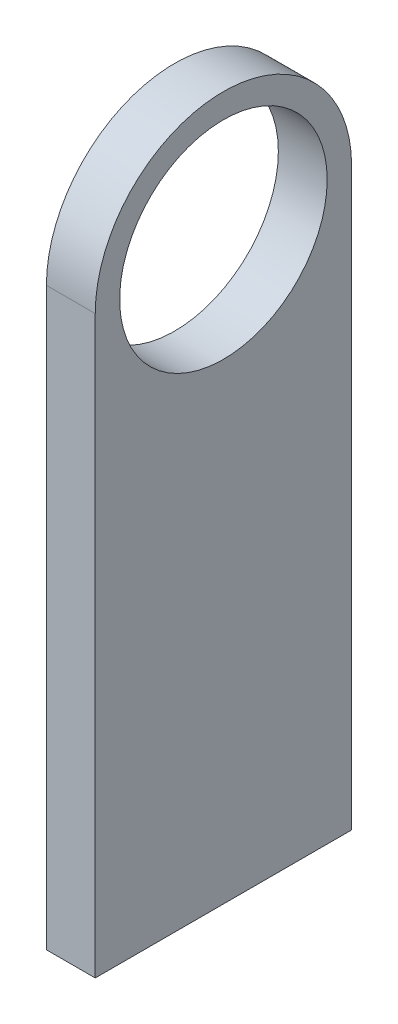
ISO-10303-21;
HEADER;
FILE_DESCRIPTION(('STEP AP214'),'2;1');
FILE_NAME('part.step','',(''),(''),'','','');
FILE_SCHEMA(('AUTOMOTIVE_DESIGN { 1 0 10303 214 1 1 1 1 }'));
ENDSEC;
DATA;
#1=APPLICATION_CONTEXT('core data for automotive mechanical design processes');
#2=APPLICATION_PROTOCOL_DEFINITION('international standard','automotive_design',2000,#1);
#3=PRODUCT_CONTEXT('',#1,'mechanical');
#4=PRODUCT('Part','Part','',(#3));
#5=PRODUCT_RELATED_PRODUCT_CATEGORY('part','',(#4));
#6=PRODUCT_DEFINITION_FORMATION('','',#4);
#7=PRODUCT_DEFINITION_CONTEXT('part definition',#1,'design');
#8=PRODUCT_DEFINITION('design','',#6,#7);
#9=PRODUCT_DEFINITION_SHAPE('','',#8);
#10=(LENGTH_UNIT() NAMED_UNIT(*) SI_UNIT(.MILLI.,.METRE.));
#11=(NAMED_UNIT(*) PLANE_ANGLE_UNIT() SI_UNIT($,.RADIAN.));
#12=(NAMED_UNIT(*) SI_UNIT($,.STERADIAN.) SOLID_ANGLE_UNIT());
#13=UNCERTAINTY_MEASURE_WITH_UNIT(LENGTH_MEASURE(1.E-05),#10,'distance_accuracy_value','');
#14=(GEOMETRIC_REPRESENTATION_CONTEXT(3) GLOBAL_UNCERTAINTY_ASSIGNED_CONTEXT((#13)) GLOBAL_UNIT_ASSIGNED_CONTEXT((#10,
#11,#12)) REPRESENTATION_CONTEXT('',''));
#15=CARTESIAN_POINT('',(0.,0.,0.));
#16=DIRECTION('',(0.,0.,1.));
#17=DIRECTION('',(1.,0.,0.));
#18=AXIS2_PLACEMENT_3D('',#15,#16,#17);
#19=CARTESIAN_POINT('',(4.,0.,10.500000000001));
#20=DIRECTION('',(0.,0.,-1.));
#21=DIRECTION('',(-1.,0.,0.));
#22=AXIS2_PLACEMENT_3D('',#19,#20,#21);
#23=PLANE('',#22);
#24=DIRECTION('',(0.,-1.,0.));
#25=VECTOR('',#24,1.);
#26=CARTESIAN_POINT('',(0.,0.,10.500000000001));
#27=LINE('',#26,#25);
#28=CARTESIAN_POINT('',(0.,0.,10.500000000001));
#29=VERTEX_POINT('',#28);
#30=CARTESIAN_POINT('',(0.,-47.1379081562873,10.500000000001));
#31=VERTEX_POINT('',#30);
#32=EDGE_CURVE('E103',#29,#31,#27,.T.);
#33=ORIENTED_EDGE('',*,*,#32,.T.);
#34=DIRECTION('',(-1.,0.,0.));
#35=VECTOR('',#34,1.);
#36=CARTESIAN_POINT('',(4.,-47.1379081562873,10.500000000001));
#37=LINE('',#36,#35);
#38=CARTESIAN_POINT('',(4.,-47.1379081562873,10.500000000001));
#39=VERTEX_POINT('',#38);
#40=EDGE_CURVE('E11',#39,#31,#37,.T.);
#41=ORIENTED_EDGE('',*,*,#40,.F.);
#42=DIRECTION('',(0.,-1.,0.));
#43=VECTOR('',#42,1.);
#44=CARTESIAN_POINT('',(4.,0.,10.500000000001));
#45=LINE('',#44,#43);
#46=CARTESIAN_POINT('',(4.,0.,10.500000000001));
#47=VERTEX_POINT('',#46);
#48=EDGE_CURVE('E85',#47,#39,#45,.T.);
#49=ORIENTED_EDGE('',*,*,#48,.F.);
#50=DIRECTION('',(-1.,0.,0.));
#51=VECTOR('',#50,1.);
#52=CARTESIAN_POINT('',(4.,0.,10.500000000001));
#53=LINE('',#52,#51);
#54=EDGE_CURVE('E102',#47,#29,#53,.T.);
#55=ORIENTED_EDGE('',*,*,#54,.T.);
#56=EDGE_LOOP('',(#33,#41,#49,#55));
#57=FACE_BOUND('',#56,.T.);
#58=ADVANCED_FACE('F37',(#57),#23,.F.);
#59=CARTESIAN_POINT('',(4.,-47.1379081562873,0.));
#60=DIRECTION('',(0.,1.,0.));
#61=DIRECTION('',(0.,0.,1.));
#62=AXIS2_PLACEMENT_3D('',#59,#60,#61);
#63=PLANE('',#62);
#64=DIRECTION('',(0.,0.,-1.));
#65=VECTOR('',#64,1.);
#66=CARTESIAN_POINT('',(0.,-47.1379081562873,0.));
#67=LINE('',#66,#65);
#68=CARTESIAN_POINT('',(0.,-47.1379081562873,-10.500000000001));
#69=VERTEX_POINT('',#68);
#70=EDGE_CURVE('E90',#31,#69,#67,.T.);
#71=ORIENTED_EDGE('',*,*,#70,.T.);
#72=DIRECTION('',(-1.,0.,0.));
#73=VECTOR('',#72,1.);
#74=CARTESIAN_POINT('',(4.,-47.1379081562873,-10.500000000001));
#75=LINE('',#74,#73);
#76=CARTESIAN_POINT('',(4.,-47.1379081562873,-10.500000000001));
#77=VERTEX_POINT('',#76);
#78=EDGE_CURVE('E45',#77,#69,#75,.T.);
#79=ORIENTED_EDGE('',*,*,#78,.F.);
#80=DIRECTION('',(0.,0.,-1.));
#81=VECTOR('',#80,1.);
#82=CARTESIAN_POINT('',(4.,-47.1379081562873,0.));
#83=LINE('',#82,#81);
#84=EDGE_CURVE('E79',#39,#77,#83,.T.);
#85=ORIENTED_EDGE('',*,*,#84,.F.);
#86=ORIENTED_EDGE('',*,*,#40,.T.);
#87=EDGE_LOOP('',(#71,#79,#85,#86));
#88=FACE_BOUND('',#87,.T.);
#89=ADVANCED_FACE('F89',(#88),#63,.F.);
#90=CARTESIAN_POINT('',(4.,0.,-10.500000000001));
#91=DIRECTION('',(0.,0.,-1.));
#92=DIRECTION('',(-1.,0.,0.));
#93=AXIS2_PLACEMENT_3D('',#90,#91,#92);
#94=PLANE('',#93);
#95=DIRECTION('',(0.,-1.,0.));
#96=VECTOR('',#95,1.);
#97=CARTESIAN_POINT('',(0.,0.,-10.500000000001));
#98=LINE('',#97,#96);
#99=CARTESIAN_POINT('',(0.,0.,-10.500000000001));
#100=VERTEX_POINT('',#99);
#101=EDGE_CURVE('E107',#100,#69,#98,.T.);
#102=ORIENTED_EDGE('',*,*,#101,.F.);
#103=DIRECTION('',(-1.,0.,0.));
#104=VECTOR('',#103,1.);
#105=CARTESIAN_POINT('',(4.,0.,-10.500000000001));
#106=LINE('',#105,#104);
#107=CARTESIAN_POINT('',(4.,0.,-10.500000000001));
#108=VERTEX_POINT('',#107);
#109=EDGE_CURVE('E69',#108,#100,#106,.T.);
#110=ORIENTED_EDGE('',*,*,#109,.F.);
#111=DIRECTION('',(0.,-1.,0.));
#112=VECTOR('',#111,1.);
#113=CARTESIAN_POINT('',(4.,0.,-10.500000000001));
#114=LINE('',#113,#112);
#115=EDGE_CURVE('E83',#108,#77,#114,.T.);
#116=ORIENTED_EDGE('',*,*,#115,.T.);
#117=ORIENTED_EDGE('',*,*,#78,.T.);
#118=EDGE_LOOP('',(#102,#110,#116,#117));
#119=FACE_BOUND('',#118,.T.);
#120=ADVANCED_FACE('F94',(#119),#94,.T.);
#121=CARTESIAN_POINT('',(4.,0.,0.));
#122=DIRECTION('',(-1.,0.,0.));
#123=DIRECTION('',(0.,0.,1.));
#124=AXIS2_PLACEMENT_3D('',#121,#122,#123);
#125=CYLINDRICAL_SURFACE('',#124,10.500000000001);
#126=CARTESIAN_POINT('',(0.,0.,0.));
#127=DIRECTION('',(1.,0.,0.));
#128=DIRECTION('',(0.,0.,-1.));
#129=AXIS2_PLACEMENT_3D('',#126,#127,#128);
#130=CIRCLE('',#129,10.500000000001);
#131=EDGE_CURVE('E72',#100,#29,#130,.T.);
#132=ORIENTED_EDGE('',*,*,#131,.T.);
#133=ORIENTED_EDGE('',*,*,#54,.F.);
#134=CARTESIAN_POINT('',(4.,0.,0.));
#135=DIRECTION('',(1.,0.,0.));
#136=DIRECTION('',(0.,0.,-1.));
#137=AXIS2_PLACEMENT_3D('',#134,#135,#136);
#138=CIRCLE('',#137,10.500000000001);
#139=EDGE_CURVE('E53',#108,#47,#138,.T.);
#140=ORIENTED_EDGE('',*,*,#139,.F.);
#141=ORIENTED_EDGE('',*,*,#109,.T.);
#142=EDGE_LOOP('',(#132,#133,#140,#141));
#143=FACE_BOUND('',#142,.T.);
#144=ADVANCED_FACE('F125',(#143),#125,.T.);
#145=CARTESIAN_POINT('',(4.,0.,0.));
#146=DIRECTION('',(-1.,0.,0.));
#147=DIRECTION('',(0.,0.,1.));
#148=AXIS2_PLACEMENT_3D('',#145,#146,#147);
#149=CYLINDRICAL_SURFACE('',#148,8.50000000000007);
#150=CARTESIAN_POINT('',(4.,0.,0.));
#151=DIRECTION('',(1.,0.,0.));
#152=DIRECTION('',(0.,0.,-1.));
#153=AXIS2_PLACEMENT_3D('',#150,#151,#152);
#154=CIRCLE('',#153,8.50000000000007);
#155=CARTESIAN_POINT('',(4.,0.,-8.50000000000007));
#156=VERTEX_POINT('',#155);
#157=EDGE_CURVE('E96',#156,#156,#154,.T.);
#158=ORIENTED_EDGE('',*,*,#157,.T.);
#159=EDGE_LOOP('',(#158));
#160=FACE_BOUND('',#159,.T.);
#161=CARTESIAN_POINT('',(0.,0.,0.));
#162=DIRECTION('',(1.,0.,0.));
#163=DIRECTION('',(0.,0.,-1.));
#164=AXIS2_PLACEMENT_3D('',#161,#162,#163);
#165=CIRCLE('',#164,8.50000000000007);
#166=CARTESIAN_POINT('',(0.,0.,-8.50000000000007));
#167=VERTEX_POINT('',#166);
#168=EDGE_CURVE('E110',#167,#167,#165,.T.);
#169=ORIENTED_EDGE('',*,*,#168,.F.);
#170=EDGE_LOOP('',(#169));
#171=FACE_BOUND('',#170,.T.);
#172=ADVANCED_FACE('F123',(#160,#171),#149,.F.);
#173=CARTESIAN_POINT('',(4.,0.,0.));
#174=DIRECTION('',(1.,0.,0.));
#175=DIRECTION('',(0.,0.,-1.));
#176=AXIS2_PLACEMENT_3D('',#173,#174,#175);
#177=PLANE('',#176);
#178=ORIENTED_EDGE('',*,*,#48,.T.);
#179=ORIENTED_EDGE('',*,*,#84,.T.);
#180=ORIENTED_EDGE('',*,*,#115,.F.);
#181=ORIENTED_EDGE('',*,*,#139,.T.);
#182=EDGE_LOOP('',(#178,#179,#180,#181));
#183=FACE_BOUND('',#182,.T.);
#184=ORIENTED_EDGE('',*,*,#157,.F.);
#185=EDGE_LOOP('',(#184));
#186=FACE_BOUND('',#185,.T.);
#187=ADVANCED_FACE('F80',(#183,#186),#177,.T.);
#188=CARTESIAN_POINT('',(0.,0.,0.));
#189=DIRECTION('',(1.,0.,0.));
#190=DIRECTION('',(0.,0.,-1.));
#191=AXIS2_PLACEMENT_3D('',#188,#189,#190);
#192=PLANE('',#191);
#193=ORIENTED_EDGE('',*,*,#32,.F.);
#194=ORIENTED_EDGE('',*,*,#131,.F.);
#195=ORIENTED_EDGE('',*,*,#101,.T.);
#196=ORIENTED_EDGE('',*,*,#70,.F.);
#197=EDGE_LOOP('',(#193,#194,#195,#196));
#198=FACE_BOUND('',#197,.T.);
#199=ORIENTED_EDGE('',*,*,#168,.T.);
#200=EDGE_LOOP('',(#199));
#201=FACE_BOUND('',#200,.T.);
#202=ADVANCED_FACE('F117',(#198,#201),#192,.F.);
#203=CLOSED_SHELL('',(#58,#89,#120,#144,#172,#187,#202));
#204=MANIFOLD_SOLID_BREP('B2',#203);
#205=ADVANCED_BREP_SHAPE_REPRESENTATION('',(#18,#204),#14);
#206=SHAPE_DEFINITION_REPRESENTATION(#9,#205);
ENDSEC;
END-ISO-10303-21;
